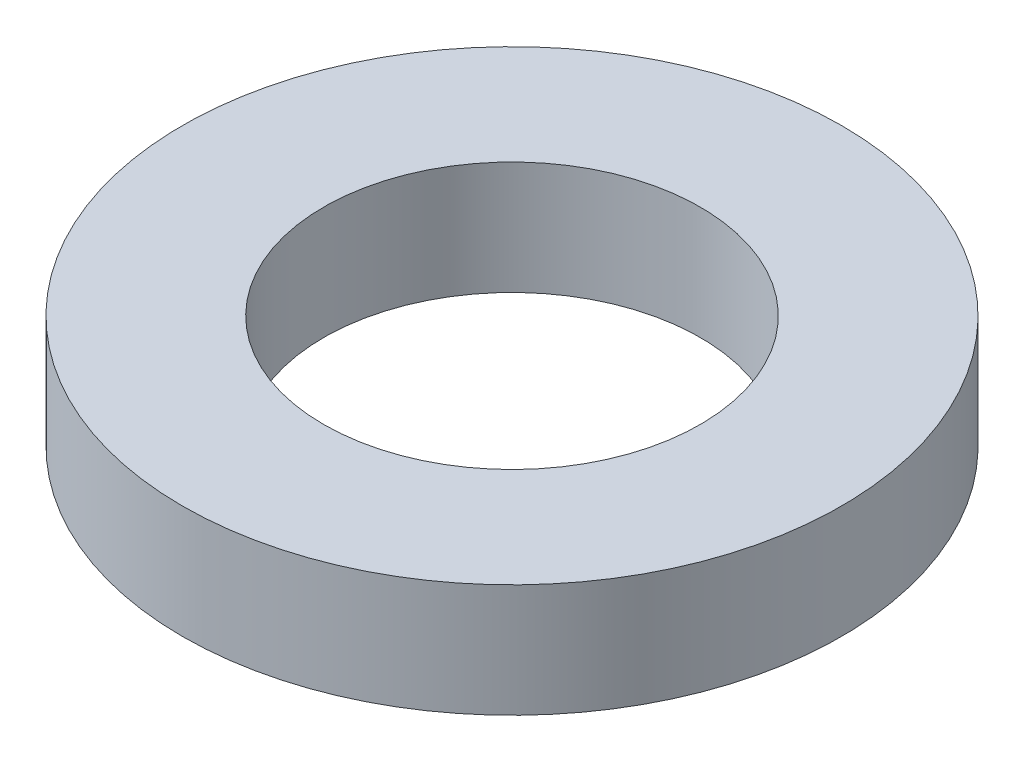
ISO-10303-21;
HEADER;
FILE_DESCRIPTION(('STEP AP214'),'2;1');
FILE_NAME('part.step','',(''),(''),'','','');
FILE_SCHEMA(('AUTOMOTIVE_DESIGN { 1 0 10303 214 1 1 1 1 }'));
ENDSEC;
DATA;
#1=APPLICATION_CONTEXT('core data for automotive mechanical design processes');
#2=APPLICATION_PROTOCOL_DEFINITION('international standard','automotive_design',2000,#1);
#3=PRODUCT_CONTEXT('',#1,'mechanical');
#4=PRODUCT('Part','Part','',(#3));
#5=PRODUCT_RELATED_PRODUCT_CATEGORY('part','',(#4));
#6=PRODUCT_DEFINITION_FORMATION('','',#4);
#7=PRODUCT_DEFINITION_CONTEXT('part definition',#1,'design');
#8=PRODUCT_DEFINITION('design','',#6,#7);
#9=PRODUCT_DEFINITION_SHAPE('','',#8);
#10=(LENGTH_UNIT() NAMED_UNIT(*) SI_UNIT(.MILLI.,.METRE.));
#11=(NAMED_UNIT(*) PLANE_ANGLE_UNIT() SI_UNIT($,.RADIAN.));
#12=(NAMED_UNIT(*) SI_UNIT($,.STERADIAN.) SOLID_ANGLE_UNIT());
#13=UNCERTAINTY_MEASURE_WITH_UNIT(LENGTH_MEASURE(1.E-05),#10,'distance_accuracy_value','');
#14=(GEOMETRIC_REPRESENTATION_CONTEXT(3) GLOBAL_UNCERTAINTY_ASSIGNED_CONTEXT((#13)) GLOBAL_UNIT_ASSIGNED_CONTEXT((#10,
#11,#12)) REPRESENTATION_CONTEXT('',''));
#15=CARTESIAN_POINT('',(0.,0.,0.));
#16=DIRECTION('',(0.,0.,1.));
#17=DIRECTION('',(1.,0.,0.));
#18=AXIS2_PLACEMENT_3D('',#15,#16,#17);
#19=CARTESIAN_POINT('',(0.,18.,0.));
#20=DIRECTION('',(0.,-1.,0.));
#21=DIRECTION('',(0.,0.,-1.));
#22=AXIS2_PLACEMENT_3D('',#19,#20,#21);
#23=CYLINDRICAL_SURFACE('',#22,52.5);
#24=CARTESIAN_POINT('',(0.,18.,0.));
#25=DIRECTION('',(0.,1.,0.));
#26=DIRECTION('',(0.,0.,1.));
#27=AXIS2_PLACEMENT_3D('',#24,#25,#26);
#28=CIRCLE('',#27,52.5);
#29=CARTESIAN_POINT('',(0.,18.,52.5));
#30=VERTEX_POINT('',#29);
#31=EDGE_CURVE('E10',#30,#30,#28,.T.);
#32=ORIENTED_EDGE('',*,*,#31,.F.);
#33=EDGE_LOOP('',(#32));
#34=FACE_BOUND('',#33,.T.);
#35=CARTESIAN_POINT('',(0.,0.,0.));
#36=DIRECTION('',(0.,1.,0.));
#37=DIRECTION('',(0.,0.,1.));
#38=AXIS2_PLACEMENT_3D('',#35,#36,#37);
#39=CIRCLE('',#38,52.5);
#40=CARTESIAN_POINT('',(0.,0.,52.5));
#41=VERTEX_POINT('',#40);
#42=EDGE_CURVE('E37',#41,#41,#39,.T.);
#43=ORIENTED_EDGE('',*,*,#42,.T.);
#44=EDGE_LOOP('',(#43));
#45=FACE_BOUND('',#44,.T.);
#46=ADVANCED_FACE('F40',(#34,#45),#23,.T.);
#47=CARTESIAN_POINT('',(0.,18.,0.));
#48=DIRECTION('',(0.,1.,0.));
#49=DIRECTION('',(0.,0.,1.));
#50=AXIS2_PLACEMENT_3D('',#47,#48,#49);
#51=PLANE('',#50);
#52=CARTESIAN_POINT('',(0.,18.,0.));
#53=DIRECTION('',(0.,1.,0.));
#54=DIRECTION('',(0.,0.,1.));
#55=AXIS2_PLACEMENT_3D('',#52,#53,#54);
#56=CIRCLE('',#55,30.);
#57=CARTESIAN_POINT('',(0.,18.,30.));
#58=VERTEX_POINT('',#57);
#59=EDGE_CURVE('E50',#58,#58,#56,.T.);
#60=ORIENTED_EDGE('',*,*,#59,.F.);
#61=EDGE_LOOP('',(#60));
#62=FACE_BOUND('',#61,.T.);
#63=ORIENTED_EDGE('',*,*,#31,.T.);
#64=EDGE_LOOP('',(#63));
#65=FACE_BOUND('',#64,.T.);
#66=ADVANCED_FACE('F59',(#62,#65),#51,.T.);
#67=CARTESIAN_POINT('',(0.,0.,0.));
#68=DIRECTION('',(0.,1.,0.));
#69=DIRECTION('',(0.,0.,1.));
#70=AXIS2_PLACEMENT_3D('',#67,#68,#69);
#71=PLANE('',#70);
#72=CARTESIAN_POINT('',(0.,0.,0.));
#73=DIRECTION('',(0.,1.,0.));
#74=DIRECTION('',(0.,0.,1.));
#75=AXIS2_PLACEMENT_3D('',#72,#73,#74);
#76=CIRCLE('',#75,30.);
#77=CARTESIAN_POINT('',(0.,0.,30.));
#78=VERTEX_POINT('',#77);
#79=EDGE_CURVE('E47',#78,#78,#76,.T.);
#80=ORIENTED_EDGE('',*,*,#79,.T.);
#81=EDGE_LOOP('',(#80));
#82=FACE_BOUND('',#81,.T.);
#83=ORIENTED_EDGE('',*,*,#42,.F.);
#84=EDGE_LOOP('',(#83));
#85=FACE_BOUND('',#84,.T.);
#86=ADVANCED_FACE('F58',(#82,#85),#71,.F.);
#87=CARTESIAN_POINT('',(0.,18.,0.));
#88=DIRECTION('',(0.,-1.,0.));
#89=DIRECTION('',(0.,0.,-1.));
#90=AXIS2_PLACEMENT_3D('',#87,#88,#89);
#91=CYLINDRICAL_SURFACE('',#90,30.);
#92=ORIENTED_EDGE('',*,*,#59,.T.);
#93=EDGE_LOOP('',(#92));
#94=FACE_BOUND('',#93,.T.);
#95=ORIENTED_EDGE('',*,*,#79,.F.);
#96=EDGE_LOOP('',(#95));
#97=FACE_BOUND('',#96,.T.);
#98=ADVANCED_FACE('F54',(#94,#97),#91,.F.);
#99=CLOSED_SHELL('',(#46,#66,#86,#98));
#100=MANIFOLD_SOLID_BREP('B2',#99);
#101=ADVANCED_BREP_SHAPE_REPRESENTATION('',(#18,#100),#14);
#102=SHAPE_DEFINITION_REPRESENTATION(#9,#101);
ENDSEC;
END-ISO-10303-21;
